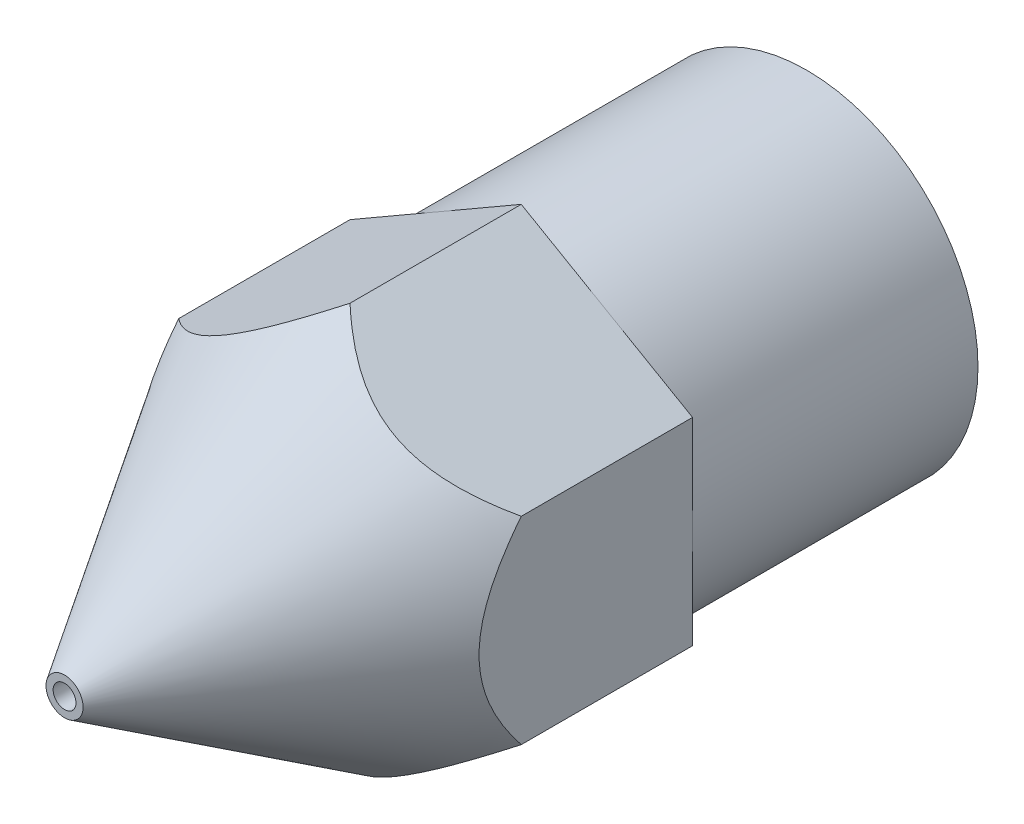
ISO-10303-21;
HEADER;
FILE_DESCRIPTION(('STEP AP214'),'2;1');
FILE_NAME('part.step','',(''),(''),'','','');
FILE_SCHEMA(('AUTOMOTIVE_DESIGN { 1 0 10303 214 1 1 1 1 }'));
ENDSEC;
DATA;
#1=APPLICATION_CONTEXT('core data for automotive mechanical design processes');
#2=APPLICATION_PROTOCOL_DEFINITION('international standard','automotive_design',2000,#1);
#3=PRODUCT_CONTEXT('',#1,'mechanical');
#4=PRODUCT('Part','Part','',(#3));
#5=PRODUCT_RELATED_PRODUCT_CATEGORY('part','',(#4));
#6=PRODUCT_DEFINITION_FORMATION('','',#4);
#7=PRODUCT_DEFINITION_CONTEXT('part definition',#1,'design');
#8=PRODUCT_DEFINITION('design','',#6,#7);
#9=PRODUCT_DEFINITION_SHAPE('','',#8);
#10=(LENGTH_UNIT() NAMED_UNIT(*) SI_UNIT(.MILLI.,.METRE.));
#11=(NAMED_UNIT(*) PLANE_ANGLE_UNIT() SI_UNIT($,.RADIAN.));
#12=(NAMED_UNIT(*) SI_UNIT($,.STERADIAN.) SOLID_ANGLE_UNIT());
#13=UNCERTAINTY_MEASURE_WITH_UNIT(LENGTH_MEASURE(1.E-05),#10,'distance_accuracy_value','');
#14=(GEOMETRIC_REPRESENTATION_CONTEXT(3) GLOBAL_UNCERTAINTY_ASSIGNED_CONTEXT((#13)) GLOBAL_UNIT_ASSIGNED_CONTEXT((#10,
#11,#12)) REPRESENTATION_CONTEXT('',''));
#15=CARTESIAN_POINT('',(0.,0.,0.));
#16=DIRECTION('',(0.,0.,1.));
#17=DIRECTION('',(1.,0.,0.));
#18=AXIS2_PLACEMENT_3D('',#15,#16,#17);
#19=CARTESIAN_POINT('',(0.,0.,-5.));
#20=DIRECTION('',(0.,0.,-1.));
#21=DIRECTION('',(-1.,0.,0.));
#22=AXIS2_PLACEMENT_3D('',#19,#20,#21);
#23=CONICAL_SURFACE('',#22,3.46410161513775,0.560624842548866);
#24=CARTESIAN_POINT('',(0.,0.,0.));
#25=DIRECTION('',(0.,0.,1.));
#26=DIRECTION('',(1.,0.,0.));
#27=AXIS2_PLACEMENT_3D('',#24,#25,#26);
#28=CIRCLE('',#27,0.325);
#29=CARTESIAN_POINT('',(0.325,0.,0.));
#30=VERTEX_POINT('',#29);
#31=EDGE_CURVE('E45',#30,#30,#28,.T.);
#32=ORIENTED_EDGE('',*,*,#31,.F.);
#33=EDGE_LOOP('',(#32));
#34=FACE_BOUND('',#33,.T.);
#35=CARTESIAN_POINT('',(-0.000200000000005751,3.4642170851916,-5.00018393133021));
#36=CARTESIAN_POINT('',(0.0634987231969383,3.4274406102068,-4.9416617668324));
#37=CARTESIAN_POINT('',(0.12837536187311,3.389984065403,-4.88473550790262));
#38=CARTESIAN_POINT('',(0.261153867909904,3.31332435920006,-4.77506106009251));
#39=CARTESIAN_POINT('',(0.329068010802212,3.2741141105194,-4.72233277872062));
#40=CARTESIAN_POINT('',(0.469589888330684,3.1929837667013,-4.6214655603265));
#41=CARTESIAN_POINT('',(0.542268869791663,3.15102253719038,-4.5734566731678));
#42=CARTESIAN_POINT('',(0.691012374338947,3.0651454347998,-4.48539002010311));
#43=CARTESIAN_POINT('',(0.767070406894757,3.02123330922968,-4.44531775459968));
#44=CARTESIAN_POINT('',(0.938229554834348,2.9224145290925,-4.36838732157165));
#45=CARTESIAN_POINT('',(1.03411610783591,2.86705440190537,-4.33374223957824));
#46=CARTESIAN_POINT('',(1.18027586096302,2.78266902909272,-4.29600519180045));
#47=CARTESIAN_POINT('',(1.22920866029133,2.75441766422831,-4.28580907398805));
#48=CARTESIAN_POINT('',(1.32765324289612,2.69758065796121,-4.2704279812667));
#49=CARTESIAN_POINT('',(1.37716475691404,2.66899517201502,-4.26524076298856));
#50=CARTESIAN_POINT('',(1.47675690028644,2.61149562122979,-4.2600813867304));
#51=CARTESIAN_POINT('',(1.52683904277556,2.58258068278206,-4.26014767562973));
#52=CARTESIAN_POINT('',(1.62677867949121,2.52488050662154,-4.26557421632856));
#53=CARTESIAN_POINT('',(1.67663617026778,2.49609527090057,-4.27093454915201));
#54=CARTESIAN_POINT('',(1.82555686729584,2.41011586638353,-4.29471685945193));
#55=CARTESIAN_POINT('',(1.92373285576054,2.35343393301548,-4.32085089576798));
#56=CARTESIAN_POINT('',(2.15221473418327,2.22151985900316,-4.40319093143127));
#57=CARTESIAN_POINT('',(2.28037300362653,2.14752764764121,-4.46709299088425));
#58=CARTESIAN_POINT('',(2.46518595252503,2.04082584184493,-4.5787314730684));
#59=CARTESIAN_POINT('',(2.52565348720162,2.00591489442217,-4.61866012686064));
#60=CARTESIAN_POINT('',(2.64432854331223,1.93739781883061,-4.70277514749944));
#61=CARTESIAN_POINT('',(2.70253669634428,1.90379132600853,-4.74696031225907));
#62=CARTESIAN_POINT('',(2.80090996920717,1.84699549044007,-4.82589638387922));
#63=CARTESIAN_POINT('',(2.84157270098775,1.82351885130056,-4.85983432626284));
#64=CARTESIAN_POINT('',(2.92169954222631,1.77725759794217,-4.92903780437979));
#65=CARTESIAN_POINT('',(2.96116896108666,1.75446991833841,-4.9642951310283));
#66=CARTESIAN_POINT('',(3.00020000000001,1.73193533751505,-5.00018393133021));
#67=B_SPLINE_CURVE_WITH_KNOTS('',3,(#35,#36,#37,#38,#39,#40,#41,#42,#43,#44,#45,#46,#47,#48,#49,
#50,#51,#52,#53,#54,#55,#56,#57,#58,#59,#60,#61,#62,#63,#64,#65,#66),.UNSPECIFIED.,.F.,.F.,(4,2,
2,2,2,2,2,2,2,2,2,2,2,2,2,4),(0.,0.282063285345548,0.565393054982907,0.855101647712909,
1.14427598141915,1.49079317101374,1.66285046394512,1.83483066063939,2.00806957991758,
2.18131115061352,2.52859815355347,3.00931447774296,3.25052992573987,3.49167745035956,
3.66545452901822,3.83828803952064),.UNSPECIFIED.);
#68=CARTESIAN_POINT('',(0.,3.46410161513776,-5.));
#69=VERTEX_POINT('',#68);
#70=CARTESIAN_POINT('',(3.,1.73205080756886,-5.));
#71=VERTEX_POINT('',#70);
#72=EDGE_CURVE('E165',#69,#71,#67,.T.);
#73=ORIENTED_EDGE('',*,*,#72,.F.);
#74=CARTESIAN_POINT('',(-3.00020000000001,1.73193533751508,-5.00018393133021));
#75=CARTESIAN_POINT('',(-2.93650127680305,1.76871181249986,-4.94166176683241));
#76=CARTESIAN_POINT('',(-2.87162463812688,1.80616835730366,-4.88473550790263));
#77=CARTESIAN_POINT('',(-2.73884613209008,1.8828280635066,-4.77506106009252));
#78=CARTESIAN_POINT('',(-2.67093198919778,1.92203831218726,-4.72233277872063));
#79=CARTESIAN_POINT('',(-2.5304101116693,2.00316865600535,-4.62146556032652));
#80=CARTESIAN_POINT('',(-2.45773113020832,2.04512988551628,-4.57345667316782));
#81=CARTESIAN_POINT('',(-2.30898762566104,2.13100698790685,-4.48539002010312));
#82=CARTESIAN_POINT('',(-2.23292959310524,2.17491911347697,-4.44531775459969));
#83=CARTESIAN_POINT('',(-2.06177044516566,2.27373789361416,-4.36838732157165));
#84=CARTESIAN_POINT('',(-1.96588389216409,2.32909802080128,-4.33374223957826));
#85=CARTESIAN_POINT('',(-1.81972413903697,2.41348339361392,-4.29600519180048));
#86=CARTESIAN_POINT('',(-1.77079133970865,2.44173475847833,-4.28580907398808));
#87=CARTESIAN_POINT('',(-1.67234675710387,2.49857176474544,-4.27042798126672));
#88=CARTESIAN_POINT('',(-1.62283524308596,2.52715725069164,-4.26524076298856));
#89=CARTESIAN_POINT('',(-1.52324309971356,2.58465680147687,-4.2600813867304));
#90=CARTESIAN_POINT('',(-1.47316095722443,2.61357173992458,-4.26014767562976));
#91=CARTESIAN_POINT('',(-1.37322132050877,2.6712719160851,-4.2655742163286));
#92=CARTESIAN_POINT('',(-1.3233638297322,2.70005715180607,-4.27093454915204));
#93=CARTESIAN_POINT('',(-1.17444313270413,2.78603655632312,-4.29471685945195));
#94=CARTESIAN_POINT('',(-1.07626714423941,2.84271848969119,-4.32085089576798));
#95=CARTESIAN_POINT('',(-0.847785265816687,2.9746325637035,-4.40319093143126));
#96=CARTESIAN_POINT('',(-0.719626996373445,3.04862477506543,-4.46709299088427));
#97=CARTESIAN_POINT('',(-0.53481404747497,3.15532658086169,-4.57873147306844));
#98=CARTESIAN_POINT('',(-0.47434651279838,3.19023752828446,-4.61866012686067));
#99=CARTESIAN_POINT('',(-0.355671456687777,3.258754603876,-4.70277514749946));
#100=CARTESIAN_POINT('',(-0.29746330365572,3.29236109669808,-4.74696031225907));
#101=CARTESIAN_POINT('',(-0.19909003079283,3.34915693226654,-4.82589638387922));
#102=CARTESIAN_POINT('',(-0.158427299012255,3.37263357140604,-4.85983432626285));
#103=CARTESIAN_POINT('',(-0.0783004577736991,3.41889482476445,-4.92903780437981));
#104=CARTESIAN_POINT('',(-0.0388310389133563,3.44168250436822,-4.96429513102831));
#105=CARTESIAN_POINT('',(0.000200000000005751,3.4642170851916,-5.00018393133021));
#106=B_SPLINE_CURVE_WITH_KNOTS('',3,(#74,#75,#76,#77,#78,#79,#80,#81,#82,#83,#84,#85,#86,#87,
#88,#89,#90,#91,#92,#93,#94,#95,#96,#97,#98,#99,#100,#101,#102,#103,#104,#105),.UNSPECIFIED.,
.F.,.F.,(4,2,2,2,2,2,2,2,2,2,2,2,2,2,2,4),(0.,0.282063285345545,0.565393054982908,
0.855101647712908,1.14427598141914,1.49079317101373,1.66285046394511,1.83483066063937,
2.00806957991758,2.18131115061353,2.5285981535535,3.00931447774295,3.25052992573985,
3.49167745035951,3.66545452901818,3.83828803952061),.UNSPECIFIED.);
#107=CARTESIAN_POINT('',(-3.,1.7320508075689,-5.));
#108=VERTEX_POINT('',#107);
#109=EDGE_CURVE('E130',#108,#69,#106,.T.);
#110=ORIENTED_EDGE('',*,*,#109,.F.);
#111=CARTESIAN_POINT('',(-3.,-6.63654114684205,-11.0829625302982));
#112=CARTESIAN_POINT('',(-3.00000000000003,-6.46912749450552,-10.840027988464));
#113=CARTESIAN_POINT('',(-3.00000000000004,-6.30102805333647,-10.597560624521));
#114=CARTESIAN_POINT('',(-3.00000000000005,-5.96297201069977,-10.1138542679894));
#115=CARTESIAN_POINT('',(-3.00000000000004,-5.79301505222333,-9.87261552507963));
#116=CARTESIAN_POINT('',(-3.00000000000004,-5.45111002284599,-9.39215832072626));
#117=CARTESIAN_POINT('',(-3.00000000000005,-5.27916576200373,-9.15293715303168));
#118=CARTESIAN_POINT('',(-3.00000000000003,-4.93235924574503,-8.67666246768658));
#119=CARTESIAN_POINT('',(-3.,-4.7574973840532,-8.43960866413192));
#120=CARTESIAN_POINT('',(-3.,-4.40382499495973,-7.96834659399568));
#121=CARTESIAN_POINT('',(-3.00000000000002,-4.22501328988193,-7.7341392092632));
#122=CARTESIAN_POINT('',(-3.00000000000004,-3.86200213351023,-7.26975177133844));
#123=CARTESIAN_POINT('',(-3.00000000000003,-3.6778005698146,-7.03957335523432));
#124=CARTESIAN_POINT('',(-3.00000000000003,-3.39527136342019,-6.69834107683538));
#125=CARTESIAN_POINT('',(-3.00000000000003,-3.29977189118796,-6.58494754981813));
#126=CARTESIAN_POINT('',(-3.00000000000003,-3.10643282646501,-6.36017732100017));
#127=CARTESIAN_POINT('',(-3.00000000000002,-3.008593363517,-6.24880050815051));
#128=CARTESIAN_POINT('',(-3.00000000000003,-2.81011259730092,-6.0287094934323));
#129=CARTESIAN_POINT('',(-3.00000000000005,-2.70947339658073,-5.91999340291024));
#130=CARTESIAN_POINT('',(-3.,-2.50463750805956,-5.70597957557956));
#131=CARTESIAN_POINT('',(-2.99999999999995,-2.40044139932657,-5.60068128774343));
#132=CARTESIAN_POINT('',(-2.99999999999995,-2.18597663360497,-5.39317615814896));
#133=CARTESIAN_POINT('',(-3.,-2.07564096919192,-5.29103804470256));
#134=CARTESIAN_POINT('',(-3.00000000000004,-1.84891971205103,-5.09335201512781));
#135=CARTESIAN_POINT('',(-3.00000000000002,-1.73252761112951,-4.99781145628927));
#136=CARTESIAN_POINT('',(-3.00000000000001,-1.49339291106095,-4.8174749030904));
#137=CARTESIAN_POINT('',(-3.00000000000002,-1.37072390214154,-4.73258260582982));
#138=CARTESIAN_POINT('',(-3.00000000000001,-1.11645555353574,-4.57753298498733));
#139=CARTESIAN_POINT('',(-3.,-0.984881108122956,-4.50733666237981));
#140=CARTESIAN_POINT('',(-3.00000000000001,-0.791412835370404,-4.42347660383706));
#141=CARTESIAN_POINT('',(-3.00000000000001,-0.733466799640258,-4.40066834172279));
#142=CARTESIAN_POINT('',(-3.00000000000002,-0.615964996934188,-4.35960126986594));
#143=CARTESIAN_POINT('',(-3.00000000000001,-0.556409273791204,-4.34134233637996));
#144=CARTESIAN_POINT('',(-3.00000000000001,-0.436038287469838,-4.3100588350453));
#145=CARTESIAN_POINT('',(-3.00000000000002,-0.375225465211998,-4.29702497190653));
#146=CARTESIAN_POINT('',(-3.00000000000001,-0.252648883827736,-4.27670629466653));
#147=CARTESIAN_POINT('',(-3.,-0.190885347928219,-4.26942015138004));
#148=CARTESIAN_POINT('',(-3.,-0.0664573509827105,-4.26091252950115));
#149=CARTESIAN_POINT('',(-3.00000000000001,-0.00378961512449266,-4.25973822366151));
#150=CARTESIAN_POINT('',(-3.00000000000001,0.121347353488008,-4.26364234406448));
#151=CARTESIAN_POINT('',(-3.00000000000001,0.183816587225356,-4.26872073929253));
#152=CARTESIAN_POINT('',(-3.00000000000001,0.308035420604226,-4.28488275799554));
#153=CARTESIAN_POINT('',(-3.00000000000001,0.369784127005301,-4.2959731628918));
#154=CARTESIAN_POINT('',(-3.00000000000001,0.492041307418696,-4.3236574184055));
#155=CARTESIAN_POINT('',(-3.,0.552549301172998,-4.34025335895797));
#156=CARTESIAN_POINT('',(-3.,0.689345673805227,-4.38382530230162));
#157=CARTESIAN_POINT('',(-3.00000000000001,0.76511827221863,-4.41241593559275));
#158=CARTESIAN_POINT('',(-3.00000000000001,0.913804539083815,-4.4762291620243));
#159=CARTESIAN_POINT('',(-3.,0.986716924298811,-4.51145469171275));
#160=CARTESIAN_POINT('',(-3.00000000000001,1.12994547440829,-4.58734266010241));
#161=CARTESIAN_POINT('',(-3.00000000000002,1.20025194290713,-4.62802322141666));
#162=CARTESIAN_POINT('',(-2.99999999999999,1.33817691616159,-4.71362547437995));
#163=CARTESIAN_POINT('',(-2.99999999999996,1.4057962172374,-4.75854589606014));
#164=CARTESIAN_POINT('',(-2.99999999999992,1.59900893749596,-4.89410700908759));
#165=CARTESIAN_POINT('',(-2.99999999999998,1.72146499460415,-4.989210845124));
#166=CARTESIAN_POINT('',(-3.00000000000002,1.95962149548198,-5.18759310740456));
#167=CARTESIAN_POINT('',(-3.00000000000001,2.07531465788705,-5.29088007233194));
#168=CARTESIAN_POINT('',(-2.99999999999999,2.30176449494103,-5.50344800021307));
#169=CARTESIAN_POINT('',(-3.,2.41250294604963,-5.61274824306849));
#170=CARTESIAN_POINT('',(-3.,2.62973830009979,-5.83536641579927));
#171=CARTESIAN_POINT('',(-3.,2.73623691574916,-5.94868268767995));
#172=CARTESIAN_POINT('',(-3.,2.94712326206313,-6.17965458997732));
#173=CARTESIAN_POINT('',(-3.,3.0514725526219,-6.29734516747991));
#174=CARTESIAN_POINT('',(-2.99999999999999,3.25745150741577,-6.53509132793474));
#175=CARTESIAN_POINT('',(-2.99999999999999,3.35908093090823,-6.65514711861615));
#176=CARTESIAN_POINT('',(-2.99999999999999,3.66026278564655,-7.0175562640097));
#177=CARTESIAN_POINT('',(-3.,3.85653693450578,-7.26263013613284));
#178=CARTESIAN_POINT('',(-3.,4.27960662639079,-7.80413717089822));
#179=CARTESIAN_POINT('',(-2.99999999999999,4.50516510583248,-8.10152815520047));
#180=CARTESIAN_POINT('',(-2.99999999999998,4.95070917602215,-8.70076244896268));
#181=CARTESIAN_POINT('',(-2.99999999999998,5.17069071608597,-9.00260875613343));
#182=CARTESIAN_POINT('',(-2.99999999999998,5.59991273714219,-9.59995364276362));
#183=CARTESIAN_POINT('',(-2.99999999999998,5.80927600934734,-9.89536425761744));
#184=CARTESIAN_POINT('',(-2.99999999999998,6.12108868753205,-10.3398496079439));
#185=CARTESIAN_POINT('',(-2.99999999999998,6.22460965715784,-10.4881748041095));
#186=CARTESIAN_POINT('',(-2.99999999999998,6.43102412142708,-10.7852588452439));
#187=CARTESIAN_POINT('',(-2.99999999999997,6.53391762293365,-10.934017685443));
#188=CARTESIAN_POINT('',(-2.99999999999995,6.63654114684208,-11.0829625302982));
#189=B_SPLINE_CURVE_WITH_KNOTS('',3,(#111,#112,#113,#114,#115,#116,#117,#118,#119,#120,#121,
#122,#123,#124,#125,#126,#127,#128,#129,#130,#131,#132,#133,#134,#135,#136,#137,#138,#139,#140,
#141,#142,#143,#144,#145,#146,#147,#148,#149,#150,#151,#152,#153,#154,#155,#156,#157,#158,#159,
#160,#161,#162,#163,#164,#165,#166,#167,#168,#169,#170,#171,#172,#173,#174,#175,#176,#177,#178,
#179,#180,#181,#182,#183,#184,#185,#186,#187,#188),.UNSPECIFIED.,.F.,.F.,(4,2,2,2,2,2,2,2,2,2,2,
2,2,2,2,2,2,2,2,2,2,2,2,2,2,2,2,2,2,2,2,2,2,2,2,2,2,2,4),(0.,0.88510484605214,1.77038290735556,
2.65417878145886,3.53785633846306,4.4218010252887,5.30609691599535,5.75082440316147,
6.19552732678812,6.63990485229516,7.08421037454215,7.53508520264425,7.98645496658969,
8.43339205130339,8.8791276191247,9.06579534568927,9.2524579942691,9.43878708441659,
9.62507307250817,9.81279475466859,10.0005155056985,10.1884484437526,10.3764528040902,
10.6190112132871,10.8616772300856,11.1051703812115,11.348590828698,11.813142822633,
12.2781861041495,12.7448188235319,13.2112610904284,13.6830756723378,14.1549318786055,
15.0967188699751,16.2163848845182,17.336842105122,18.4230532654191,18.9656869119797,
19.5083146126314),.UNSPECIFIED.);
#190=CARTESIAN_POINT('',(-3.,-1.73205080756886,-5.));
#191=VERTEX_POINT('',#190);
#192=EDGE_CURVE('E119',#191,#108,#189,.T.);
#193=ORIENTED_EDGE('',*,*,#192,.F.);
#194=CARTESIAN_POINT('',(0.000200000000005751,-3.46421708519157,-5.00018393133021));
#195=CARTESIAN_POINT('',(-0.063498723196942,-3.42744061020679,-4.9416617668324));
#196=CARTESIAN_POINT('',(-0.128375361873112,-3.38998406540299,-4.88473550790262));
#197=CARTESIAN_POINT('',(-0.261153867909903,-3.31332435920006,-4.77506106009251));
#198=CARTESIAN_POINT('',(-0.329068010802208,-3.2741141105194,-4.72233277872062));
#199=CARTESIAN_POINT('',(-0.469589888330677,-3.19298376670131,-4.62146556032651));
#200=CARTESIAN_POINT('',(-0.542268869791656,-3.15102253719039,-4.57345667316781));
#201=CARTESIAN_POINT('',(-0.69101237433892,-3.06514543479981,-4.48539002010311));
#202=CARTESIAN_POINT('',(-0.767070406894709,-3.02123330922967,-4.44531775459969));
#203=CARTESIAN_POINT('',(-0.93822955483429,-2.92241452909248,-4.36838732157165));
#204=CARTESIAN_POINT('',(-1.03411610783587,-2.86705440190537,-4.33374223957825));
#205=CARTESIAN_POINT('',(-1.180275860963,-2.78266902909275,-4.29600519180046));
#206=CARTESIAN_POINT('',(-1.22920866029131,-2.75441766422834,-4.28580907398806));
#207=CARTESIAN_POINT('',(-1.32765324289608,-2.69758065796121,-4.2704279812667));
#208=CARTESIAN_POINT('',(-1.37716475691398,-2.66899517201498,-4.26524076298856));
#209=CARTESIAN_POINT('',(-1.47675690028639,-2.61149562122974,-4.2600813867304));
#210=CARTESIAN_POINT('',(-1.52683904277553,-2.58258068278206,-4.26014767562973));
#211=CARTESIAN_POINT('',(-1.62677867949121,-2.52488050662156,-4.26557421632855));
#212=CARTESIAN_POINT('',(-1.67663617026777,-2.49609527090058,-4.27093454915201));
#213=CARTESIAN_POINT('',(-1.82555686729583,-2.41011586638352,-4.29471685945193));
#214=CARTESIAN_POINT('',(-1.92373285576054,-2.35343393301546,-4.32085089576798));
#215=CARTESIAN_POINT('',(-2.15221473418327,-2.22151985900314,-4.40319093143127));
#216=CARTESIAN_POINT('',(-2.28037300362654,-2.1475276476412,-4.46709299088425));
#217=CARTESIAN_POINT('',(-2.46518595252503,-2.04082584184493,-4.57873147306841));
#218=CARTESIAN_POINT('',(-2.52565348720163,-2.00591489442216,-4.61866012686064));
#219=CARTESIAN_POINT('',(-2.64432854331223,-1.93739781883061,-4.70277514749945));
#220=CARTESIAN_POINT('',(-2.70253669634428,-1.90379132600852,-4.74696031225907));
#221=CARTESIAN_POINT('',(-2.80090996920717,-1.84699549044007,-4.82589638387923));
#222=CARTESIAN_POINT('',(-2.84157270098775,-1.82351885130056,-4.85983432626284));
#223=CARTESIAN_POINT('',(-2.92169954222632,-1.77725759794217,-4.92903780437979));
#224=CARTESIAN_POINT('',(-2.96116896108666,-1.75446991833839,-4.9642951310283));
#225=CARTESIAN_POINT('',(-3.00020000000001,-1.73193533751502,-5.00018393133021));
#226=B_SPLINE_CURVE_WITH_KNOTS('',3,(#194,#195,#196,#197,#198,#199,#200,#201,#202,#203,#204,
#205,#206,#207,#208,#209,#210,#211,#212,#213,#214,#215,#216,#217,#218,#219,#220,#221,#222,#223,
#224,#225),.UNSPECIFIED.,.F.,.F.,(4,2,2,2,2,2,2,2,2,2,2,2,2,2,2,4),(0.,0.282063285345538,
0.565393054982889,0.855101647712877,1.1442759814191,1.4907931710137,1.66285046394508,
1.83483066063935,2.00806957991756,2.1813111506135,2.52859815355347,3.00931447774296,
3.25052992573987,3.49167745035955,3.66545452901822,3.83828803952065),.UNSPECIFIED.);
#227=CARTESIAN_POINT('',(0.,-3.46410161513774,-5.));
#228=VERTEX_POINT('',#227);
#229=EDGE_CURVE('E224',#228,#191,#226,.T.);
#230=ORIENTED_EDGE('',*,*,#229,.F.);
#231=CARTESIAN_POINT('',(3.00020000000001,-1.73193533751505,-5.00018393133021));
#232=CARTESIAN_POINT('',(2.93650127680306,-1.76871181249982,-4.9416617668324));
#233=CARTESIAN_POINT('',(2.87162463812689,-1.80616835730363,-4.88473550790262));
#234=CARTESIAN_POINT('',(2.7388461320901,-1.88282806350656,-4.77506106009251));
#235=CARTESIAN_POINT('',(2.6709319891978,-1.92203831218722,-4.72233277872062));
#236=CARTESIAN_POINT('',(2.53041011166933,-2.00316865600531,-4.62146556032651));
#237=CARTESIAN_POINT('',(2.45773113020835,-2.04512988551622,-4.57345667316781));
#238=CARTESIAN_POINT('',(2.30898762566108,-2.13100698790681,-4.48539002010311));
#239=CARTESIAN_POINT('',(2.23292959310529,-2.17491911347696,-4.44531775459969));
#240=CARTESIAN_POINT('',(2.06177044516571,-2.27373789361415,-4.36838732157165));
#241=CARTESIAN_POINT('',(1.96588389216412,-2.32909802080125,-4.33374223957824));
#242=CARTESIAN_POINT('',(1.81972413903697,-2.41348339361388,-4.29600519180044));
#243=CARTESIAN_POINT('',(1.77079133970866,-2.44173475847829,-4.28580907398804));
#244=CARTESIAN_POINT('',(1.67234675710388,-2.49857176474542,-4.27042798126669));
#245=CARTESIAN_POINT('',(1.62283524308597,-2.52715725069165,-4.26524076298856));
#246=CARTESIAN_POINT('',(1.52324309971356,-2.58465680147688,-4.2600813867304));
#247=CARTESIAN_POINT('',(1.47316095722443,-2.61357173992457,-4.26014767562973));
#248=CARTESIAN_POINT('',(1.37322132050876,-2.67127191608507,-4.26557421632854));
#249=CARTESIAN_POINT('',(1.32336382973219,-2.70005715180604,-4.270934549152));
#250=CARTESIAN_POINT('',(1.17444313270415,-2.7860365563231,-4.29471685945192));
#251=CARTESIAN_POINT('',(1.07626714423946,-2.84271848969118,-4.32085089576798));
#252=CARTESIAN_POINT('',(0.847785265816737,-2.9746325637035,-4.40319093143127));
#253=CARTESIAN_POINT('',(0.719626996373458,-3.04862477506541,-4.46709299088425));
#254=CARTESIAN_POINT('',(0.53481404747495,-3.15532658086167,-4.5787314730684));
#255=CARTESIAN_POINT('',(0.474346512798353,-3.19023752828443,-4.61866012686062));
#256=CARTESIAN_POINT('',(0.355671456687765,-3.25875460387599,-4.70277514749944));
#257=CARTESIAN_POINT('',(0.297463303655729,-3.29236109669809,-4.74696031225908));
#258=CARTESIAN_POINT('',(0.199090030792828,-3.34915693226655,-4.82589638387923));
#259=CARTESIAN_POINT('',(0.158427299012235,-3.37263357140604,-4.85983432626284));
#260=CARTESIAN_POINT('',(0.0783004577736617,-3.41889482476443,-4.92903780437978));
#261=CARTESIAN_POINT('',(0.0388310389133202,-3.4416825043682,-4.96429513102829));
#262=CARTESIAN_POINT('',(-0.000200000000005751,-3.4642170851916,-5.00018393133021));
#263=B_SPLINE_CURVE_WITH_KNOTS('',3,(#231,#232,#233,#234,#235,#236,#237,#238,#239,#240,#241,
#242,#243,#244,#245,#246,#247,#248,#249,#250,#251,#252,#253,#254,#255,#256,#257,#258,#259,#260,
#261,#262),.UNSPECIFIED.,.F.,.F.,(4,2,2,2,2,2,2,2,2,2,2,2,2,2,2,4),(0.,0.282063285345541,
0.565393054982892,0.855101647712881,1.14427598141911,1.49079317101373,1.66285046394513,
1.83483066063941,2.0080695799176,2.18131115061354,2.52859815355348,3.00931447774297,
3.25052992573988,3.49167745035956,3.66545452901823,3.83828803952065),.UNSPECIFIED.);
#264=CARTESIAN_POINT('',(3.,-1.73205080756889,-5.));
#265=VERTEX_POINT('',#264);
#266=EDGE_CURVE('E225',#265,#228,#263,.T.);
#267=ORIENTED_EDGE('',*,*,#266,.F.);
#268=CARTESIAN_POINT('',(3.00000000000011,6.63654114684205,-11.0829625302982));
#269=CARTESIAN_POINT('',(3.00000000000006,6.46912749450551,-10.840027988464));
#270=CARTESIAN_POINT('',(3.00000000000005,6.30102805333647,-10.597560624521));
#271=CARTESIAN_POINT('',(3.00000000000004,5.96297201069977,-10.1138542679895));
#272=CARTESIAN_POINT('',(3.00000000000005,5.79301505222334,-9.87261552507963));
#273=CARTESIAN_POINT('',(3.00000000000004,5.451110022846,-9.39215832072627));
#274=CARTESIAN_POINT('',(3.00000000000002,5.27916576200373,-9.15293715303169));
#275=CARTESIAN_POINT('',(3.00000000000006,4.93235924574505,-8.67666246768659));
#276=CARTESIAN_POINT('',(3.00000000000011,4.75749738405324,-8.43960866413191));
#277=CARTESIAN_POINT('',(3.00000000000011,4.40382499495978,-7.96834659399568));
#278=CARTESIAN_POINT('',(3.00000000000005,4.22501328988195,-7.73413920926322));
#279=CARTESIAN_POINT('',(3.00000000000001,3.86200213351024,-7.26975177133847));
#280=CARTESIAN_POINT('',(3.00000000000003,3.67780056981462,-7.03957335523434));
#281=CARTESIAN_POINT('',(3.00000000000003,3.39527136342021,-6.6983410768354));
#282=CARTESIAN_POINT('',(3.00000000000003,3.29977189118797,-6.58494754981815));
#283=CARTESIAN_POINT('',(3.00000000000003,3.10643282646503,-6.36017732100019));
#284=CARTESIAN_POINT('',(3.00000000000003,3.00859336351702,-6.24880050815052));
#285=CARTESIAN_POINT('',(3.00000000000002,2.81011259730094,-6.02870949343233));
#286=CARTESIAN_POINT('',(3.00000000000002,2.70947339658074,-5.91999340291026));
#287=CARTESIAN_POINT('',(3.00000000000003,2.50463750805958,-5.70597957557957));
#288=CARTESIAN_POINT('',(3.00000000000006,2.40044139932661,-5.60068128774343));
#289=CARTESIAN_POINT('',(3.00000000000006,2.18597663360501,-5.39317615814896));
#290=CARTESIAN_POINT('',(3.00000000000003,2.07564096919194,-5.29103804470258));
#291=CARTESIAN_POINT('',(3.00000000000001,1.84891971205105,-5.09335201512784));
#292=CARTESIAN_POINT('',(3.00000000000002,1.73252761112953,-4.99781145628929));
#293=CARTESIAN_POINT('',(3.00000000000002,1.49339291106098,-4.81747490309042));
#294=CARTESIAN_POINT('',(3.00000000000002,1.37072390214156,-4.73258260582985));
#295=CARTESIAN_POINT('',(3.00000000000001,1.11645555353578,-4.57753298498734));
#296=CARTESIAN_POINT('',(3.,0.984881108122999,-4.5073366623798));
#297=CARTESIAN_POINT('',(3.00000000000001,0.791412835370443,-4.42347660383706));
#298=CARTESIAN_POINT('',(3.00000000000001,0.733466799640293,-4.4006683417228));
#299=CARTESIAN_POINT('',(3.00000000000002,0.61596499693422,-4.35960126986595));
#300=CARTESIAN_POINT('',(3.00000000000001,0.556409273791237,-4.34134233637997));
#301=CARTESIAN_POINT('',(3.00000000000001,0.436038287469871,-4.3100588350453));
#302=CARTESIAN_POINT('',(3.00000000000002,0.375225465212031,-4.29702497190654));
#303=CARTESIAN_POINT('',(3.00000000000001,0.252648883827767,-4.27670629466654));
#304=CARTESIAN_POINT('',(3.,0.190885347928248,-4.26942015138004));
#305=CARTESIAN_POINT('',(3.,0.0664573509827347,-4.26091252950115));
#306=CARTESIAN_POINT('',(3.00000000000001,0.00378961512451312,-4.25973822366151));
#307=CARTESIAN_POINT('',(3.00000000000001,-0.121347353487994,-4.26364234406448));
#308=CARTESIAN_POINT('',(3.00000000000001,-0.183816587225347,-4.26872073929253));
#309=CARTESIAN_POINT('',(3.00000000000001,-0.308035420604223,-4.28488275799554));
#310=CARTESIAN_POINT('',(3.00000000000001,-0.369784127005301,-4.2959731628918));
#311=CARTESIAN_POINT('',(3.00000000000001,-0.492041307418703,-4.3236574184055));
#312=CARTESIAN_POINT('',(3.,-0.552549301173009,-4.34025335895796));
#313=CARTESIAN_POINT('',(3.,-0.689345673805238,-4.38382530230162));
#314=CARTESIAN_POINT('',(3.00000000000001,-0.765118272218637,-4.41241593559275));
#315=CARTESIAN_POINT('',(3.00000000000001,-0.913804539083816,-4.4762291620243));
#316=CARTESIAN_POINT('',(3.00000000000001,-0.98671692429881,-4.51145469171275));
#317=CARTESIAN_POINT('',(3.00000000000001,-1.12994547440828,-4.5873426601024));
#318=CARTESIAN_POINT('',(3.00000000000001,-1.20025194290713,-4.62802322141666));
#319=CARTESIAN_POINT('',(3.,-1.33817691616158,-4.71362547437995));
#320=CARTESIAN_POINT('',(3.,-1.40579621723738,-4.75854589606013));
#321=CARTESIAN_POINT('',(3.,-1.59900893749595,-4.89410700908758));
#322=CARTESIAN_POINT('',(3.,-1.72146499460414,-4.98921084512399));
#323=CARTESIAN_POINT('',(3.,-1.95962149548197,-5.18759310740454));
#324=CARTESIAN_POINT('',(3.,-2.07531465788704,-5.29088007233193));
#325=CARTESIAN_POINT('',(3.,-2.30176449494102,-5.50344800021306));
#326=CARTESIAN_POINT('',(3.,-2.41250294604962,-5.61274824306847));
#327=CARTESIAN_POINT('',(3.,-2.62973830009978,-5.83536641579926));
#328=CARTESIAN_POINT('',(3.,-2.73623691574915,-5.94868268767993));
#329=CARTESIAN_POINT('',(3.,-2.94712326206312,-6.1796545899773));
#330=CARTESIAN_POINT('',(3.,-3.05147255262188,-6.2973451674799));
#331=CARTESIAN_POINT('',(2.99999999999999,-3.25745150741576,-6.53509132793473));
#332=CARTESIAN_POINT('',(2.99999999999999,-3.35908093090822,-6.65514711861613));
#333=CARTESIAN_POINT('',(2.99999999999999,-3.66026278564653,-7.01755626400968));
#334=CARTESIAN_POINT('',(3.,-3.85653693450576,-7.26263013613282));
#335=CARTESIAN_POINT('',(3.,-4.27960662639077,-7.8041371708982));
#336=CARTESIAN_POINT('',(2.99999999999999,-4.50516510583246,-8.10152815520045));
#337=CARTESIAN_POINT('',(2.99999999999998,-4.95070917602215,-8.70076244896266));
#338=CARTESIAN_POINT('',(2.99999999999998,-5.17069071608596,-9.00260875613342));
#339=CARTESIAN_POINT('',(2.99999999999998,-5.59991273714219,-9.59995364276361));
#340=CARTESIAN_POINT('',(2.99999999999998,-5.80927600934734,-9.89536425761744));
#341=CARTESIAN_POINT('',(2.99999999999998,-6.12108868753205,-10.3398496079439));
#342=CARTESIAN_POINT('',(2.99999999999998,-6.22460965715784,-10.4881748041095));
#343=CARTESIAN_POINT('',(2.99999999999998,-6.43102412142708,-10.7852588452439));
#344=CARTESIAN_POINT('',(2.99999999999999,-6.53391762293366,-10.934017685443));
#345=CARTESIAN_POINT('',(3.,-6.63654114684209,-11.0829625302982));
#346=B_SPLINE_CURVE_WITH_KNOTS('',3,(#268,#269,#270,#271,#272,#273,#274,#275,#276,#277,#278,
#279,#280,#281,#282,#283,#284,#285,#286,#287,#288,#289,#290,#291,#292,#293,#294,#295,#296,#297,
#298,#299,#300,#301,#302,#303,#304,#305,#306,#307,#308,#309,#310,#311,#312,#313,#314,#315,#316,
#317,#318,#319,#320,#321,#322,#323,#324,#325,#326,#327,#328,#329,#330,#331,#332,#333,#334,#335,
#336,#337,#338,#339,#340,#341,#342,#343,#344,#345),.UNSPECIFIED.,.F.,.F.,(4,2,2,2,2,2,2,2,2,2,2,
2,2,2,2,2,2,2,2,2,2,2,2,2,2,2,2,2,2,2,2,2,2,2,2,2,2,2,4),(0.,0.885104846052135,1.77038290735555,
2.65417878145884,3.53785633846303,4.42180102528867,5.30609691599532,5.75082440316145,
6.1955273267881,6.63990485229513,7.08421037454212,7.53508520264422,7.98645496658966,
8.43339205130336,8.87912761912467,9.06579534568924,9.25245799426907,9.43878708441657,
9.62507307250815,9.81279475466858,10.0005155056985,10.1884484437526,10.3764528040903,
10.6190112132871,10.8616772300856,11.1051703812115,11.348590828698,11.813142822633,
12.2781861041495,12.7448188235319,13.2112610904283,13.6830756723378,14.1549318786055,
15.096718869975,16.2163848845182,17.336842105122,18.4230532654191,18.9656869119797,
19.5083146126314),.UNSPECIFIED.);
#347=EDGE_CURVE('E202',#71,#265,#346,.T.);
#348=ORIENTED_EDGE('',*,*,#347,.F.);
#349=EDGE_LOOP('',(#73,#110,#193,#230,#267,#348));
#350=FACE_BOUND('',#349,.T.);
#351=ADVANCED_FACE('F37',(#34,#350),#23,.T.);
#352=CARTESIAN_POINT('',(0.,3.46410161513777,-8.));
#353=DIRECTION('',(0.,0.,1.));
#354=DIRECTION('',(1.,0.,0.));
#355=AXIS2_PLACEMENT_3D('',#352,#353,#354);
#356=PLANE('',#355);
#357=DIRECTION('',(0.866025403784441,0.499999999999996,0.));
#358=VECTOR('',#357,1.);
#359=CARTESIAN_POINT('',(2.99999999999995,-1.73205080756889,-8.));
#360=LINE('',#359,#358);
#361=CARTESIAN_POINT('',(0.,-3.46410161513773,-8.));
#362=VERTEX_POINT('',#361);
#363=CARTESIAN_POINT('',(1.49999999999995,-2.5980762113533,-8.));
#364=VERTEX_POINT('',#363);
#365=EDGE_CURVE('E228',#362,#364,#360,.T.);
#366=ORIENTED_EDGE('',*,*,#365,.F.);
#367=DIRECTION('',(0.866025403784436,-0.500000000000004,0.));
#368=VECTOR('',#367,1.);
#369=CARTESIAN_POINT('',(-3.,-1.73205080756884,-8.));
#370=LINE('',#369,#368);
#371=CARTESIAN_POINT('',(-1.5,-2.5980762113533,-8.));
#372=VERTEX_POINT('',#371);
#373=EDGE_CURVE('E128',#372,#362,#370,.T.);
#374=ORIENTED_EDGE('',*,*,#373,.F.);
#375=CARTESIAN_POINT('',(0.,0.,-8.));
#376=DIRECTION('',(0.,0.,1.));
#377=DIRECTION('',(1.,0.,0.));
#378=AXIS2_PLACEMENT_3D('',#375,#376,#377);
#379=CIRCLE('',#378,3.);
#380=EDGE_CURVE('E264',#372,#364,#379,.T.);
#381=ORIENTED_EDGE('',*,*,#380,.T.);
#382=EDGE_LOOP('',(#366,#374,#381));
#383=FACE_BOUND('',#382,.T.);
#384=ADVANCED_FACE('F198',(#383),#356,.F.);
#385=CARTESIAN_POINT('',(2.99999999999995,-1.7320508075689,-8.));
#386=VERTEX_POINT('',#385);
#387=EDGE_CURVE('E226',#364,#386,#360,.T.);
#388=ORIENTED_EDGE('',*,*,#387,.F.);
#389=CARTESIAN_POINT('',(2.99999999999995,0.,-8.));
#390=VERTEX_POINT('',#389);
#391=EDGE_CURVE('E187',#364,#390,#379,.T.);
#392=ORIENTED_EDGE('',*,*,#391,.T.);
#393=DIRECTION('',(0.,1.,0.));
#394=VECTOR('',#393,1.);
#395=CARTESIAN_POINT('',(3.,3.46410161513777,-8.));
#396=LINE('',#395,#394);
#397=EDGE_CURVE('E251',#386,#390,#396,.T.);
#398=ORIENTED_EDGE('',*,*,#397,.F.);
#399=EDGE_LOOP('',(#388,#392,#398));
#400=FACE_BOUND('',#399,.T.);
#401=ADVANCED_FACE('F260',(#400),#356,.F.);
#402=CARTESIAN_POINT('',(2.99999999999995,1.73205080756887,-8.));
#403=VERTEX_POINT('',#402);
#404=EDGE_CURVE('E211',#390,#403,#396,.T.);
#405=ORIENTED_EDGE('',*,*,#404,.F.);
#406=CARTESIAN_POINT('',(1.49999999999995,2.59807621135331,-8.));
#407=VERTEX_POINT('',#406);
#408=EDGE_CURVE('E188',#390,#407,#379,.T.);
#409=ORIENTED_EDGE('',*,*,#408,.T.);
#410=DIRECTION('',(-0.866025403784436,0.500000000000004,0.));
#411=VECTOR('',#410,1.);
#412=CARTESIAN_POINT('',(0.,3.46410161513777,-8.));
#413=LINE('',#412,#411);
#414=EDGE_CURVE('E173',#403,#407,#413,.T.);
#415=ORIENTED_EDGE('',*,*,#414,.F.);
#416=EDGE_LOOP('',(#405,#409,#415));
#417=FACE_BOUND('',#416,.T.);
#418=ADVANCED_FACE('F257',(#417),#356,.F.);
#419=CARTESIAN_POINT('',(-3.,-1.73205080756886,-8.));
#420=VERTEX_POINT('',#419);
#421=EDGE_CURVE('E227',#420,#372,#370,.T.);
#422=ORIENTED_EDGE('',*,*,#421,.F.);
#423=DIRECTION('',(0.,-1.,0.));
#424=VECTOR('',#423,1.);
#425=CARTESIAN_POINT('',(-3.,3.46410161513779,-8.));
#426=LINE('',#425,#424);
#427=CARTESIAN_POINT('',(-3.,0.,-8.));
#428=VERTEX_POINT('',#427);
#429=EDGE_CURVE('E126',#428,#420,#426,.T.);
#430=ORIENTED_EDGE('',*,*,#429,.F.);
#431=EDGE_CURVE('E272',#428,#372,#379,.T.);
#432=ORIENTED_EDGE('',*,*,#431,.T.);
#433=EDGE_LOOP('',(#422,#430,#432));
#434=FACE_BOUND('',#433,.T.);
#435=ADVANCED_FACE('F279',(#434),#356,.F.);
#436=CARTESIAN_POINT('',(0.,3.46410161513776,-8.));
#437=VERTEX_POINT('',#436);
#438=EDGE_CURVE('E174',#407,#437,#413,.T.);
#439=ORIENTED_EDGE('',*,*,#438,.F.);
#440=CARTESIAN_POINT('',(-1.50000000000006,2.59807621135333,-8.));
#441=VERTEX_POINT('',#440);
#442=EDGE_CURVE('E190',#407,#441,#379,.T.);
#443=ORIENTED_EDGE('',*,*,#442,.T.);
#444=DIRECTION('',(-0.866025403784441,-0.499999999999996,0.));
#445=VECTOR('',#444,1.);
#446=CARTESIAN_POINT('',(0.,3.46410161513777,-8.));
#447=LINE('',#446,#445);
#448=EDGE_CURVE('E58',#437,#441,#447,.T.);
#449=ORIENTED_EDGE('',*,*,#448,.F.);
#450=EDGE_LOOP('',(#439,#443,#449));
#451=FACE_BOUND('',#450,.T.);
#452=ADVANCED_FACE('F281',(#451),#356,.F.);
#453=CARTESIAN_POINT('',(-3.,1.73205080756889,-8.));
#454=VERTEX_POINT('',#453);
#455=EDGE_CURVE('E115',#454,#428,#426,.T.);
#456=ORIENTED_EDGE('',*,*,#455,.F.);
#457=EDGE_CURVE('E105',#441,#454,#447,.T.);
#458=ORIENTED_EDGE('',*,*,#457,.F.);
#459=EDGE_CURVE('E125',#441,#428,#379,.T.);
#460=ORIENTED_EDGE('',*,*,#459,.T.);
#461=EDGE_LOOP('',(#456,#458,#460));
#462=FACE_BOUND('',#461,.T.);
#463=ADVANCED_FACE('F124',(#462),#356,.F.);
#464=CARTESIAN_POINT('',(0.,0.,0.));
#465=DIRECTION('',(0.,0.,1.));
#466=DIRECTION('',(1.,0.,0.));
#467=AXIS2_PLACEMENT_3D('',#464,#465,#466);
#468=CYLINDRICAL_SURFACE('',#467,0.2);
#469=CARTESIAN_POINT('',(0.,0.,-0.5));
#470=DIRECTION('',(0.,0.,1.));
#471=DIRECTION('',(1.,0.,0.));
#472=AXIS2_PLACEMENT_3D('',#469,#470,#471);
#473=CIRCLE('',#472,0.2);
#474=CARTESIAN_POINT('',(0.200000000000055,0.,-0.5));
#475=VERTEX_POINT('',#474);
#476=EDGE_CURVE('E172',#475,#475,#473,.T.);
#477=ORIENTED_EDGE('',*,*,#476,.F.);
#478=EDGE_LOOP('',(#477));
#479=FACE_BOUND('',#478,.T.);
#480=CARTESIAN_POINT('',(0.,0.,0.));
#481=DIRECTION('',(0.,0.,1.));
#482=DIRECTION('',(1.,0.,0.));
#483=AXIS2_PLACEMENT_3D('',#480,#481,#482);
#484=CIRCLE('',#483,0.2);
#485=CARTESIAN_POINT('',(0.2,0.,0.));
#486=VERTEX_POINT('',#485);
#487=EDGE_CURVE('E12',#486,#486,#484,.T.);
#488=ORIENTED_EDGE('',*,*,#487,.T.);
#489=EDGE_LOOP('',(#488));
#490=FACE_BOUND('',#489,.T.);
#491=ADVANCED_FACE('F39',(#479,#490),#468,.F.);
#492=CARTESIAN_POINT('',(0.,0.20000000000002,0.));
#493=DIRECTION('',(0.,0.,-1.));
#494=DIRECTION('',(-1.,0.,0.));
#495=AXIS2_PLACEMENT_3D('',#492,#493,#494);
#496=PLANE('',#495);
#497=ORIENTED_EDGE('',*,*,#487,.F.);
#498=EDGE_LOOP('',(#497));
#499=FACE_BOUND('',#498,.T.);
#500=ORIENTED_EDGE('',*,*,#31,.T.);
#501=EDGE_LOOP('',(#500));
#502=FACE_BOUND('',#501,.T.);
#503=ADVANCED_FACE('F194',(#499,#502),#496,.F.);
#504=CARTESIAN_POINT('',(0.,0.,0.));
#505=DIRECTION('',(0.,0.,1.));
#506=DIRECTION('',(1.,0.,0.));
#507=AXIS2_PLACEMENT_3D('',#504,#505,#506);
#508=CYLINDRICAL_SURFACE('',#507,3.);
#509=ORIENTED_EDGE('',*,*,#442,.F.);
#510=ORIENTED_EDGE('',*,*,#408,.F.);
#511=ORIENTED_EDGE('',*,*,#391,.F.);
#512=ORIENTED_EDGE('',*,*,#380,.F.);
#513=ORIENTED_EDGE('',*,*,#431,.F.);
#514=ORIENTED_EDGE('',*,*,#459,.F.);
#515=EDGE_LOOP('',(#509,#510,#511,#512,#513,#514));
#516=FACE_BOUND('',#515,.T.);
#517=CARTESIAN_POINT('',(0.,0.,-13.));
#518=DIRECTION('',(0.,0.,1.));
#519=DIRECTION('',(1.,0.,0.));
#520=AXIS2_PLACEMENT_3D('',#517,#518,#519);
#521=CIRCLE('',#520,3.);
#522=CARTESIAN_POINT('',(3.,0.,-13.));
#523=VERTEX_POINT('',#522);
#524=EDGE_CURVE('E184',#523,#523,#521,.T.);
#525=ORIENTED_EDGE('',*,*,#524,.T.);
#526=EDGE_LOOP('',(#525));
#527=FACE_BOUND('',#526,.T.);
#528=ADVANCED_FACE('F266',(#516,#527),#508,.T.);
#529=CARTESIAN_POINT('',(0.,3.00000000000003,-13.));
#530=DIRECTION('',(0.,0.,1.));
#531=DIRECTION('',(1.,0.,0.));
#532=AXIS2_PLACEMENT_3D('',#529,#530,#531);
#533=PLANE('',#532);
#534=ORIENTED_EDGE('',*,*,#524,.F.);
#535=EDGE_LOOP('',(#534));
#536=FACE_BOUND('',#535,.T.);
#537=CARTESIAN_POINT('',(0.,0.,-13.));
#538=DIRECTION('',(0.,0.,1.));
#539=DIRECTION('',(1.,0.,0.));
#540=AXIS2_PLACEMENT_3D('',#537,#538,#539);
#541=CIRCLE('',#540,1.);
#542=CARTESIAN_POINT('',(1.,0.,-13.));
#543=VERTEX_POINT('',#542);
#544=EDGE_CURVE('E181',#543,#543,#541,.T.);
#545=ORIENTED_EDGE('',*,*,#544,.T.);
#546=EDGE_LOOP('',(#545));
#547=FACE_BOUND('',#546,.T.);
#548=ADVANCED_FACE('F290',(#536,#547),#533,.F.);
#549=CARTESIAN_POINT('',(0.,0.,0.));
#550=DIRECTION('',(0.,0.,1.));
#551=DIRECTION('',(1.,0.,0.));
#552=AXIS2_PLACEMENT_3D('',#549,#550,#551);
#553=CYLINDRICAL_SURFACE('',#552,0.999999999999999);
#554=ORIENTED_EDGE('',*,*,#544,.F.);
#555=EDGE_LOOP('',(#554));
#556=FACE_BOUND('',#555,.T.);
#557=CARTESIAN_POINT('',(0.,0.,-3.));
#558=DIRECTION('',(0.,0.,1.));
#559=DIRECTION('',(1.,0.,0.));
#560=AXIS2_PLACEMENT_3D('',#557,#558,#559);
#561=CIRCLE('',#560,0.999999999999999);
#562=CARTESIAN_POINT('',(1.00000000000005,0.,-3.));
#563=VERTEX_POINT('',#562);
#564=EDGE_CURVE('E178',#563,#563,#561,.T.);
#565=ORIENTED_EDGE('',*,*,#564,.T.);
#566=EDGE_LOOP('',(#565));
#567=FACE_BOUND('',#566,.T.);
#568=ADVANCED_FACE('F292',(#556,#567),#553,.F.);
#569=CARTESIAN_POINT('',(0.,0.,-0.5));
#570=DIRECTION('',(0.,0.,-1.));
#571=DIRECTION('',(-1.,0.,0.));
#572=AXIS2_PLACEMENT_3D('',#569,#570,#571);
#573=CONICAL_SURFACE('',#572,0.2,0.309702944542456);
#574=ORIENTED_EDGE('',*,*,#564,.F.);
#575=EDGE_LOOP('',(#574));
#576=FACE_BOUND('',#575,.T.);
#577=ORIENTED_EDGE('',*,*,#476,.T.);
#578=EDGE_LOOP('',(#577));
#579=FACE_BOUND('',#578,.T.);
#580=ADVANCED_FACE('F161',(#576,#579),#573,.F.);
#581=CARTESIAN_POINT('',(3.,1.73205080756886,-13.));
#582=DIRECTION('',(0.500000000000004,0.866025403784436,0.));
#583=DIRECTION('',(-0.866025403784436,0.500000000000004,0.));
#584=AXIS2_PLACEMENT_3D('',#581,#582,#583);
#585=PLANE('',#584);
#586=ORIENTED_EDGE('',*,*,#72,.T.);
#587=DIRECTION('',(0.,0.,1.));
#588=VECTOR('',#587,1.);
#589=CARTESIAN_POINT('',(3.,1.73205080756886,-13.));
#590=LINE('',#589,#588);
#591=EDGE_CURVE('E111',#403,#71,#590,.T.);
#592=ORIENTED_EDGE('',*,*,#591,.F.);
#593=ORIENTED_EDGE('',*,*,#414,.T.);
#594=ORIENTED_EDGE('',*,*,#438,.T.);
#595=DIRECTION('',(0.,0.,1.));
#596=VECTOR('',#595,1.);
#597=CARTESIAN_POINT('',(0.,3.46410161513776,-13.));
#598=LINE('',#597,#596);
#599=EDGE_CURVE('E122',#437,#69,#598,.T.);
#600=ORIENTED_EDGE('',*,*,#599,.T.);
#601=EDGE_LOOP('',(#586,#592,#593,#594,#600));
#602=FACE_BOUND('',#601,.T.);
#603=ADVANCED_FACE('F156',(#602),#585,.T.);
#604=CARTESIAN_POINT('',(3.,-1.73205080756889,-13.));
#605=DIRECTION('',(1.,0.,0.));
#606=DIRECTION('',(0.,1.,0.));
#607=AXIS2_PLACEMENT_3D('',#604,#605,#606);
#608=PLANE('',#607);
#609=ORIENTED_EDGE('',*,*,#347,.T.);
#610=DIRECTION('',(0.,0.,1.));
#611=VECTOR('',#610,1.);
#612=CARTESIAN_POINT('',(3.,-1.73205080756889,-13.));
#613=LINE('',#612,#611);
#614=EDGE_CURVE('E212',#386,#265,#613,.T.);
#615=ORIENTED_EDGE('',*,*,#614,.F.);
#616=ORIENTED_EDGE('',*,*,#397,.T.);
#617=ORIENTED_EDGE('',*,*,#404,.T.);
#618=ORIENTED_EDGE('',*,*,#591,.T.);
#619=EDGE_LOOP('',(#609,#615,#616,#617,#618));
#620=FACE_BOUND('',#619,.T.);
#621=ADVANCED_FACE('F160',(#620),#608,.T.);
#622=CARTESIAN_POINT('',(0.,-3.46410161513773,-13.));
#623=DIRECTION('',(0.499999999999996,-0.866025403784441,0.));
#624=DIRECTION('',(0.866025403784441,0.499999999999996,0.));
#625=AXIS2_PLACEMENT_3D('',#622,#623,#624);
#626=PLANE('',#625);
#627=ORIENTED_EDGE('',*,*,#266,.T.);
#628=DIRECTION('',(0.,0.,1.));
#629=VECTOR('',#628,1.);
#630=CARTESIAN_POINT('',(0.,-3.46410161513773,-13.));
#631=LINE('',#630,#629);
#632=EDGE_CURVE('E214',#362,#228,#631,.T.);
#633=ORIENTED_EDGE('',*,*,#632,.F.);
#634=ORIENTED_EDGE('',*,*,#365,.T.);
#635=ORIENTED_EDGE('',*,*,#387,.T.);
#636=ORIENTED_EDGE('',*,*,#614,.T.);
#637=EDGE_LOOP('',(#627,#633,#634,#635,#636));
#638=FACE_BOUND('',#637,.T.);
#639=ADVANCED_FACE('F240',(#638),#626,.T.);
#640=CARTESIAN_POINT('',(-3.,-1.73205080756886,-13.));
#641=DIRECTION('',(-0.500000000000004,-0.866025403784436,0.));
#642=DIRECTION('',(0.866025403784436,-0.500000000000004,0.));
#643=AXIS2_PLACEMENT_3D('',#640,#641,#642);
#644=PLANE('',#643);
#645=ORIENTED_EDGE('',*,*,#229,.T.);
#646=DIRECTION('',(0.,0.,1.));
#647=VECTOR('',#646,1.);
#648=CARTESIAN_POINT('',(-3.,-1.73205080756886,-13.));
#649=LINE('',#648,#647);
#650=EDGE_CURVE('E121',#420,#191,#649,.T.);
#651=ORIENTED_EDGE('',*,*,#650,.F.);
#652=ORIENTED_EDGE('',*,*,#421,.T.);
#653=ORIENTED_EDGE('',*,*,#373,.T.);
#654=ORIENTED_EDGE('',*,*,#632,.T.);
#655=EDGE_LOOP('',(#645,#651,#652,#653,#654));
#656=FACE_BOUND('',#655,.T.);
#657=ADVANCED_FACE('F150',(#656),#644,.T.);
#658=CARTESIAN_POINT('',(-3.,1.7320508075689,-13.));
#659=DIRECTION('',(-1.,0.,0.));
#660=DIRECTION('',(0.,-1.,0.));
#661=AXIS2_PLACEMENT_3D('',#658,#659,#660);
#662=PLANE('',#661);
#663=ORIENTED_EDGE('',*,*,#192,.T.);
#664=DIRECTION('',(0.,0.,1.));
#665=VECTOR('',#664,1.);
#666=CARTESIAN_POINT('',(-3.,1.7320508075689,-13.));
#667=LINE('',#666,#665);
#668=EDGE_CURVE('E52',#454,#108,#667,.T.);
#669=ORIENTED_EDGE('',*,*,#668,.F.);
#670=ORIENTED_EDGE('',*,*,#455,.T.);
#671=ORIENTED_EDGE('',*,*,#429,.T.);
#672=ORIENTED_EDGE('',*,*,#650,.T.);
#673=EDGE_LOOP('',(#663,#669,#670,#671,#672));
#674=FACE_BOUND('',#673,.T.);
#675=ADVANCED_FACE('F114',(#674),#662,.T.);
#676=CARTESIAN_POINT('',(0.,3.46410161513776,-13.));
#677=DIRECTION('',(-0.499999999999996,0.866025403784441,0.));
#678=DIRECTION('',(-0.866025403784441,-0.499999999999996,0.));
#679=AXIS2_PLACEMENT_3D('',#676,#677,#678);
#680=PLANE('',#679);
#681=ORIENTED_EDGE('',*,*,#109,.T.);
#682=ORIENTED_EDGE('',*,*,#599,.F.);
#683=ORIENTED_EDGE('',*,*,#448,.T.);
#684=ORIENTED_EDGE('',*,*,#457,.T.);
#685=ORIENTED_EDGE('',*,*,#668,.T.);
#686=EDGE_LOOP('',(#681,#682,#683,#684,#685));
#687=FACE_BOUND('',#686,.T.);
#688=ADVANCED_FACE('F106',(#687),#680,.T.);
#689=CLOSED_SHELL('',(#351,#384,#401,#418,#435,#452,#463,#491,#503,#528,#548,#568,#580,#603,
#621,#639,#657,#675,#688));
#690=MANIFOLD_SOLID_BREP('B2',#689);
#691=ADVANCED_BREP_SHAPE_REPRESENTATION('',(#18,#690),#14);
#692=SHAPE_DEFINITION_REPRESENTATION(#9,#691);
ENDSEC;
END-ISO-10303-21;
